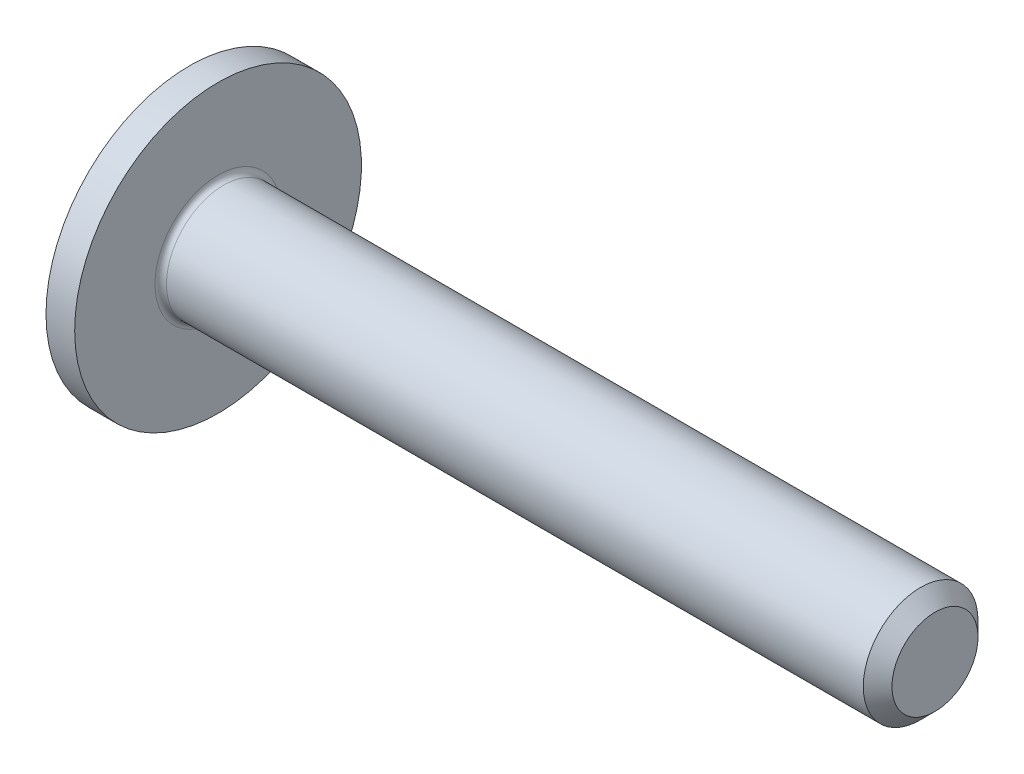
ISO-10303-21;
HEADER;
FILE_DESCRIPTION(('STEP AP214'),'2;1');
FILE_NAME('part.step','',(''),(''),'','','');
FILE_SCHEMA(('AUTOMOTIVE_DESIGN { 1 0 10303 214 1 1 1 1 }'));
ENDSEC;
DATA;
#1=APPLICATION_CONTEXT('core data for automotive mechanical design processes');
#2=APPLICATION_PROTOCOL_DEFINITION('international standard','automotive_design',2000,#1);
#3=PRODUCT_CONTEXT('',#1,'mechanical');
#4=PRODUCT('Part','Part','',(#3));
#5=PRODUCT_RELATED_PRODUCT_CATEGORY('part','',(#4));
#6=PRODUCT_DEFINITION_FORMATION('','',#4);
#7=PRODUCT_DEFINITION_CONTEXT('part definition',#1,'design');
#8=PRODUCT_DEFINITION('design','',#6,#7);
#9=PRODUCT_DEFINITION_SHAPE('','',#8);
#10=(LENGTH_UNIT() NAMED_UNIT(*) SI_UNIT(.MILLI.,.METRE.));
#11=(NAMED_UNIT(*) PLANE_ANGLE_UNIT() SI_UNIT($,.RADIAN.));
#12=(NAMED_UNIT(*) SI_UNIT($,.STERADIAN.) SOLID_ANGLE_UNIT());
#13=UNCERTAINTY_MEASURE_WITH_UNIT(LENGTH_MEASURE(1.E-05),#10,'distance_accuracy_value','');
#14=(GEOMETRIC_REPRESENTATION_CONTEXT(3) GLOBAL_UNCERTAINTY_ASSIGNED_CONTEXT((#13)) GLOBAL_UNIT_ASSIGNED_CONTEXT((#10,
#11,#12)) REPRESENTATION_CONTEXT('',''));
#15=CARTESIAN_POINT('',(0.,0.,0.));
#16=DIRECTION('',(0.,0.,1.));
#17=DIRECTION('',(1.,0.,0.));
#18=AXIS2_PLACEMENT_3D('',#15,#16,#17);
#19=CARTESIAN_POINT('',(5.8,0.,0.));
#20=DIRECTION('',(-1.,0.,0.));
#21=DIRECTION('',(0.,1.,0.));
#22=AXIS2_PLACEMENT_3D('',#19,#20,#21);
#23=SPHERICAL_SURFACE('',#22,5.8);
#24=CARTESIAN_POINT('',(2.05,0.,0.));
#25=DIRECTION('',(1.,0.,0.));
#26=DIRECTION('',(0.,0.,-1.));
#27=AXIS2_PLACEMENT_3D('',#24,#25,#26);
#28=CIRCLE('',#27,4.42464687856557);
#29=CARTESIAN_POINT('',(2.05,0.,-4.42464687856557));
#30=VERTEX_POINT('',#29);
#31=EDGE_CURVE('E425',#30,#30,#28,.F.);
#32=ORIENTED_EDGE('',*,*,#31,.T.);
#33=EDGE_LOOP('',(#32));
#34=FACE_BOUND('',#33,.T.);
#35=CARTESIAN_POINT('',(4.49544161532537,1.4868105318046,1.70147353185102));
#36=DIRECTION('',(0.5,-0.569852046972748,-0.652126248943384));
#37=DIRECTION('',(0.,0.753010530746168,-0.658008465435951));
#38=AXIS2_PLACEMENT_3D('',#35,#36,#37);
#39=CIRCLE('',#38,5.18001058723826);
#40=CARTESIAN_POINT('',(0.350670800180915,1.40442359564326,-1.40442359564326));
#41=VERTEX_POINT('',#40);
#42=CARTESIAN_POINT('',(0.0915426130173635,0.556694252642319,-0.862325791147635));
#43=VERTEX_POINT('',#42);
#44=EDGE_CURVE('E252',#41,#43,#39,.F.);
#45=ORIENTED_EDGE('',*,*,#44,.F.);
#46=CARTESIAN_POINT('',(4.49544161532537,-1.70147353185101,-1.48681053180461));
#47=DIRECTION('',(0.5,0.652126248943382,0.56985204697275));
#48=DIRECTION('',(0.,-0.658008465435953,0.753010530746166));
#49=AXIS2_PLACEMENT_3D('',#46,#47,#48);
#50=CIRCLE('',#49,5.18001058723826);
#51=CARTESIAN_POINT('',(0.0915426130173634,0.862325791147635,-0.556694252642316));
#52=VERTEX_POINT('',#51);
#53=EDGE_CURVE('E248',#52,#41,#50,.F.);
#54=ORIENTED_EDGE('',*,*,#53,.F.);
#55=CARTESIAN_POINT('',(0.0915426130173634,0.,0.));
#56=DIRECTION('',(1.,0.,0.));
#57=DIRECTION('',(0.,0.,-1.));
#58=AXIS2_PLACEMENT_3D('',#55,#56,#57);
#59=CIRCLE('',#58,1.02640842796783);
#60=CARTESIAN_POINT('',(0.0915426130173482,0.891122758840145,-0.509327487654908));
#61=VERTEX_POINT('',#60);
#62=EDGE_CURVE('E245',#61,#52,#59,.F.);
#63=ORIENTED_EDGE('',*,*,#62,.F.);
#64=CARTESIAN_POINT('',(5.80960489391217,0.,-0.155003115548179));
#65=DIRECTION('',(0.0618471864963983,0.,-0.998085630355672));
#66=DIRECTION('',(-0.998085630355672,0.,-0.0618471864963983));
#67=AXIS2_PLACEMENT_3D('',#64,#65,#66);
#68=CIRCLE('',#67,5.79792047032238);
#69=CARTESIAN_POINT('',(0.390286169611534,2.03324772703929,-0.490815600600994));
#70=VERTEX_POINT('',#69);
#71=EDGE_CURVE('E438',#61,#70,#68,.T.);
#72=ORIENTED_EDGE('',*,*,#71,.T.);
#73=CARTESIAN_POINT('',(5.91393656966609,0.380873675740914,0.));
#74=DIRECTION('',(0.286596561114572,0.958051361440138,0.));
#75=DIRECTION('',(-0.958051361440138,0.286596561114572,0.));
#76=AXIS2_PLACEMENT_3D('',#73,#74,#75);
#77=CIRCLE('',#76,5.78635927861555);
#78=CARTESIAN_POINT('',(0.390286169611536,2.03324772703929,0.490815600600995));
#79=VERTEX_POINT('',#78);
#80=EDGE_CURVE('E435',#70,#79,#77,.T.);
#81=ORIENTED_EDGE('',*,*,#80,.T.);
#82=CARTESIAN_POINT('',(5.80960489391217,0.,0.155003115548176));
#83=DIRECTION('',(0.0618471864963987,0.,0.998085630355672));
#84=DIRECTION('',(0.998085630355672,0.,-0.0618471864963988));
#85=AXIS2_PLACEMENT_3D('',#82,#83,#84);
#86=CIRCLE('',#85,5.79792047032238);
#87=CARTESIAN_POINT('',(0.091542613017363,0.891122758839946,0.509327487654907));
#88=VERTEX_POINT('',#87);
#89=EDGE_CURVE('E443',#79,#88,#86,.T.);
#90=ORIENTED_EDGE('',*,*,#89,.T.);
#91=CARTESIAN_POINT('',(0.0915426130173634,0.862325791147635,0.556694252642317));
#92=VERTEX_POINT('',#91);
#93=EDGE_CURVE('E267',#92,#88,#59,.F.);
#94=ORIENTED_EDGE('',*,*,#93,.F.);
#95=CARTESIAN_POINT('',(4.49544161532536,-1.70147353185101,1.48681053180461));
#96=DIRECTION('',(0.5,0.652126248943382,-0.56985204697275));
#97=DIRECTION('',(0.,0.658008465435953,0.753010530746166));
#98=AXIS2_PLACEMENT_3D('',#95,#96,#97);
#99=CIRCLE('',#98,5.18001058723826);
#100=CARTESIAN_POINT('',(0.350670800180912,1.40442359564326,1.40442359564326));
#101=VERTEX_POINT('',#100);
#102=EDGE_CURVE('E253',#101,#92,#99,.F.);
#103=ORIENTED_EDGE('',*,*,#102,.F.);
#104=CARTESIAN_POINT('',(4.49544161532537,1.4868105318046,-1.70147353185102));
#105=DIRECTION('',(0.5,-0.569852046972748,0.652126248943384));
#106=DIRECTION('',(0.,-0.753010530746168,-0.658008465435951));
#107=AXIS2_PLACEMENT_3D('',#104,#105,#106);
#108=CIRCLE('',#107,5.18001058723826);
#109=CARTESIAN_POINT('',(0.0915426130173635,0.556694252642319,0.862325791147635));
#110=VERTEX_POINT('',#109);
#111=EDGE_CURVE('E256',#110,#101,#108,.F.);
#112=ORIENTED_EDGE('',*,*,#111,.F.);
#113=CARTESIAN_POINT('',(0.0915426130173482,0.509327487654905,0.891122758840146));
#114=VERTEX_POINT('',#113);
#115=EDGE_CURVE('E270',#114,#110,#59,.F.);
#116=ORIENTED_EDGE('',*,*,#115,.F.);
#117=CARTESIAN_POINT('',(5.80960489391217,0.155003115548179,0.));
#118=DIRECTION('',(0.0618471864963983,0.998085630355672,0.));
#119=DIRECTION('',(-0.998085630355672,0.0618471864963983,0.));
#120=AXIS2_PLACEMENT_3D('',#117,#118,#119);
#121=CIRCLE('',#120,5.79792047032238);
#122=CARTESIAN_POINT('',(0.390286169611534,0.490815600600987,2.03324772703929));
#123=VERTEX_POINT('',#122);
#124=EDGE_CURVE('E767',#114,#123,#121,.T.);
#125=ORIENTED_EDGE('',*,*,#124,.T.);
#126=CARTESIAN_POINT('',(5.91393656966609,0.,0.380873675740914));
#127=DIRECTION('',(0.286596561114572,0.,0.958051361440138));
#128=DIRECTION('',(0.958051361440138,0.,-0.286596561114572));
#129=AXIS2_PLACEMENT_3D('',#126,#127,#128);
#130=CIRCLE('',#129,5.78635927861555);
#131=CARTESIAN_POINT('',(0.390286169611536,-0.490815600601002,2.03324772703929));
#132=VERTEX_POINT('',#131);
#133=EDGE_CURVE('E449',#123,#132,#130,.T.);
#134=ORIENTED_EDGE('',*,*,#133,.T.);
#135=CARTESIAN_POINT('',(5.80960489391217,-0.155003115548176,0.));
#136=DIRECTION('',(0.0618471864963987,-0.998085630355672,0.));
#137=DIRECTION('',(0.998085630355672,0.0618471864963988,0.));
#138=AXIS2_PLACEMENT_3D('',#135,#136,#137);
#139=CIRCLE('',#138,5.79792047032238);
#140=CARTESIAN_POINT('',(0.0915426130173487,-0.509327487654911,0.891122758840143));
#141=VERTEX_POINT('',#140);
#142=EDGE_CURVE('E771',#132,#141,#139,.T.);
#143=ORIENTED_EDGE('',*,*,#142,.T.);
#144=CARTESIAN_POINT('',(0.0915426130173635,-0.556694252642319,0.862325791147635));
#145=VERTEX_POINT('',#144);
#146=EDGE_CURVE('E740',#145,#141,#59,.F.);
#147=ORIENTED_EDGE('',*,*,#146,.F.);
#148=CARTESIAN_POINT('',(4.49544161532537,-1.4868105318046,-1.70147353185102));
#149=DIRECTION('',(0.5,0.569852046972748,0.652126248943384));
#150=DIRECTION('',(0.,-0.753010530746168,0.658008465435951));
#151=AXIS2_PLACEMENT_3D('',#148,#149,#150);
#152=CIRCLE('',#151,5.18001058723826);
#153=CARTESIAN_POINT('',(0.350670800180915,-1.40442359564326,1.40442359564326));
#154=VERTEX_POINT('',#153);
#155=EDGE_CURVE('E734',#154,#145,#152,.F.);
#156=ORIENTED_EDGE('',*,*,#155,.F.);
#157=CARTESIAN_POINT('',(4.49544161532537,1.70147353185101,1.48681053180461));
#158=DIRECTION('',(0.5,-0.652126248943382,-0.56985204697275));
#159=DIRECTION('',(0.,0.658008465435953,-0.753010530746166));
#160=AXIS2_PLACEMENT_3D('',#157,#158,#159);
#161=CIRCLE('',#160,5.18001058723826);
#162=CARTESIAN_POINT('',(0.0915426130173634,-0.862325791147635,0.556694252642316));
#163=VERTEX_POINT('',#162);
#164=EDGE_CURVE('E728',#163,#154,#161,.F.);
#165=ORIENTED_EDGE('',*,*,#164,.F.);
#166=CARTESIAN_POINT('',(0.091542613017363,-0.891122758839946,0.509327487654907));
#167=VERTEX_POINT('',#166);
#168=EDGE_CURVE('E275',#167,#163,#59,.F.);
#169=ORIENTED_EDGE('',*,*,#168,.F.);
#170=CARTESIAN_POINT('',(0.390286169611532,-2.03324772703928,0.490815600600995));
#171=VERTEX_POINT('',#170);
#172=EDGE_CURVE('E442',#167,#171,#86,.T.);
#173=ORIENTED_EDGE('',*,*,#172,.T.);
#174=CARTESIAN_POINT('',(5.91393656966608,-0.380873675740915,0.));
#175=DIRECTION('',(0.28659656111457,-0.958051361440138,0.));
#176=DIRECTION('',(0.958051361440138,0.28659656111457,0.));
#177=AXIS2_PLACEMENT_3D('',#174,#175,#176);
#178=CIRCLE('',#177,5.78635927861555);
#179=CARTESIAN_POINT('',(0.390286169611532,-2.03324772703928,-0.490815600600995));
#180=VERTEX_POINT('',#179);
#181=EDGE_CURVE('E446',#171,#180,#178,.T.);
#182=ORIENTED_EDGE('',*,*,#181,.T.);
#183=CARTESIAN_POINT('',(0.0915426130173493,-0.891122758840144,-0.509327487654908));
#184=VERTEX_POINT('',#183);
#185=EDGE_CURVE('E439',#180,#184,#68,.T.);
#186=ORIENTED_EDGE('',*,*,#185,.T.);
#187=CARTESIAN_POINT('',(0.0915426130173634,-0.862325791147635,-0.556694252642317));
#188=VERTEX_POINT('',#187);
#189=EDGE_CURVE('E741',#188,#184,#59,.F.);
#190=ORIENTED_EDGE('',*,*,#189,.F.);
#191=CARTESIAN_POINT('',(4.49544161532536,1.70147353185101,-1.48681053180461));
#192=DIRECTION('',(0.5,-0.652126248943382,0.56985204697275));
#193=DIRECTION('',(0.,-0.658008465435953,-0.753010530746166));
#194=AXIS2_PLACEMENT_3D('',#191,#192,#193);
#195=CIRCLE('',#194,5.18001058723826);
#196=CARTESIAN_POINT('',(0.350670800180914,-1.40442359564326,-1.40442359564326));
#197=VERTEX_POINT('',#196);
#198=EDGE_CURVE('E210',#197,#188,#195,.F.);
#199=ORIENTED_EDGE('',*,*,#198,.F.);
#200=CARTESIAN_POINT('',(4.49544161532537,-1.4868105318046,1.70147353185102));
#201=DIRECTION('',(0.5,0.569852046972748,-0.652126248943384));
#202=DIRECTION('',(0.,0.753010530746168,0.658008465435951));
#203=AXIS2_PLACEMENT_3D('',#200,#201,#202);
#204=CIRCLE('',#203,5.18001058723826);
#205=CARTESIAN_POINT('',(0.0915426130173635,-0.556694252642319,-0.862325791147635));
#206=VERTEX_POINT('',#205);
#207=EDGE_CURVE('E220',#206,#197,#204,.F.);
#208=ORIENTED_EDGE('',*,*,#207,.F.);
#209=CARTESIAN_POINT('',(0.0915426130173629,-0.509327487654904,-0.891122758839948));
#210=VERTEX_POINT('',#209);
#211=EDGE_CURVE('E227',#210,#206,#59,.F.);
#212=ORIENTED_EDGE('',*,*,#211,.F.);
#213=CARTESIAN_POINT('',(0.390286169611532,-0.490815600600988,-2.03324772703928));
#214=VERTEX_POINT('',#213);
#215=EDGE_CURVE('E769',#210,#214,#139,.T.);
#216=ORIENTED_EDGE('',*,*,#215,.T.);
#217=CARTESIAN_POINT('',(5.91393656966608,0.,-0.380873675740915));
#218=DIRECTION('',(0.28659656111457,0.,-0.958051361440138));
#219=DIRECTION('',(-0.958051361440138,0.,-0.28659656111457));
#220=AXIS2_PLACEMENT_3D('',#217,#218,#219);
#221=CIRCLE('',#220,5.78635927861555);
#222=CARTESIAN_POINT('',(0.390286169611532,0.490815600601002,-2.03324772703928));
#223=VERTEX_POINT('',#222);
#224=EDGE_CURVE('E451',#214,#223,#221,.T.);
#225=ORIENTED_EDGE('',*,*,#224,.T.);
#226=CARTESIAN_POINT('',(0.0915426130173631,0.50932748765491,-0.891122758839945));
#227=VERTEX_POINT('',#226);
#228=EDGE_CURVE('E765',#223,#227,#121,.T.);
#229=ORIENTED_EDGE('',*,*,#228,.T.);
#230=EDGE_CURVE('E274',#43,#227,#59,.F.);
#231=ORIENTED_EDGE('',*,*,#230,.F.);
#232=EDGE_LOOP('',(#45,#54,#63,#72,#81,#90,#94,#103,#112,#116,#125,#134,#143,#147,#156,#165,
#169,#173,#182,#186,#190,#199,#208,#212,#216,#225,#229,#231));
#233=FACE_BOUND('',#232,.T.);
#234=ADVANCED_FACE('F41',(#34,#233),#23,.T.);
#235=CARTESIAN_POINT('',(2.6,0.,0.));
#236=DIRECTION('',(-1.,0.,0.));
#237=DIRECTION('',(0.,0.,1.));
#238=AXIS2_PLACEMENT_3D('',#235,#236,#237);
#239=CONICAL_SURFACE('',#238,0.850999999999999,0.069813170079766);
#240=CARTESIAN_POINT('',(2.6,0.,0.));
#241=DIRECTION('',(-1.,0.,0.));
#242=DIRECTION('',(0.,0.,1.));
#243=AXIS2_PLACEMENT_3D('',#240,#241,#242);
#244=CIRCLE('',#243,0.850999999999999);
#245=CARTESIAN_POINT('',(2.6,0.,0.850999999999999));
#246=VERTEX_POINT('',#245);
#247=EDGE_CURVE('E261',#246,#246,#244,.T.);
#248=ORIENTED_EDGE('',*,*,#247,.F.);
#249=EDGE_LOOP('',(#248));
#250=FACE_BOUND('',#249,.T.);
#251=CARTESIAN_POINT('',(0.370538725217989,0.0918314341366152,0.0802457051897276));
#252=DIRECTION('',(0.5,0.652126248943382,0.56985204697275));
#253=DIRECTION('',(-0.866025403784438,0.376505265373083,0.329004232717977));
#254=AXIS2_PLACEMENT_3D('',#251,#252,#253);
#255=ELLIPSE('',#254,2.013798238594,0.999486593679023);
#256=CARTESIAN_POINT('',(0.465382099864511,0.707295596002861,-0.70729559600286));
#257=VERTEX_POINT('',#256);
#258=EDGE_CURVE('E49',#52,#257,#255,.F.);
#259=ORIENTED_EDGE('',*,*,#258,.T.);
#260=CARTESIAN_POINT('',(0.370538725217985,-0.0802457051897285,-0.0918314341366171));
#261=DIRECTION('',(0.5,-0.569852046972748,-0.652126248943384));
#262=DIRECTION('',(-0.866025403784439,-0.329004232717976,-0.376505265373084));
#263=AXIS2_PLACEMENT_3D('',#260,#261,#262);
#264=ELLIPSE('',#263,2.01379823859401,0.999486593679024);
#265=EDGE_CURVE('E11',#257,#43,#264,.F.);
#266=ORIENTED_EDGE('',*,*,#265,.T.);
#267=ORIENTED_EDGE('',*,*,#230,.T.);
#268=CARTESIAN_POINT('',(0.0452078804564265,0.512198656980268,-0.893212462768129));
#269=CARTESIAN_POINT('',(0.365106160426383,0.492375900315463,-0.87879018372941));
#270=CARTESIAN_POINT('',(0.684997245175192,0.472553589508378,-0.864205051965348));
#271=CARTESIAN_POINT('',(1.32476098967625,0.432910109614082,-0.834642123898892));
#272=CARTESIAN_POINT('',(1.64463364944747,0.413088940525694,-0.819664328008124));
#273=CARTESIAN_POINT('',(2.08973198362717,0.385508060843619,-0.798502412906335));
#274=CARTESIAN_POINT('',(2.2149668823717,0.377747778656458,-0.792512888403489));
#275=CARTESIAN_POINT('',(2.3402,0.369987606837611,-0.786486121868666));
#276=B_SPLINE_CURVE_WITH_KNOTS('',3,(#268,#269,#270,#271,#272,#273,#274,#275),.UNSPECIFIED.,.F.,
.F.,(4,2,2,4),(0.,0.962508687501757,1.92501636605824,2.30187028300653),.UNSPECIFIED.);
#277=CARTESIAN_POINT('',(2.34,0.370000000000003,-0.786495747306727));
#278=VERTEX_POINT('',#277);
#279=EDGE_CURVE('E337',#227,#278,#276,.T.);
#280=ORIENTED_EDGE('',*,*,#279,.T.);
#281=CARTESIAN_POINT('',(2.34,0.,0.));
#282=DIRECTION('',(-1.,0.,0.));
#283=DIRECTION('',(0.,0.,1.));
#284=AXIS2_PLACEMENT_3D('',#281,#282,#283);
#285=CIRCLE('',#284,0.86918097110531);
#286=CARTESIAN_POINT('',(2.34,-0.369999999999997,-0.78649574730673));
#287=VERTEX_POINT('',#286);
#288=EDGE_CURVE('E268',#287,#278,#285,.F.);
#289=ORIENTED_EDGE('',*,*,#288,.F.);
#290=CARTESIAN_POINT('',(2.3402,-0.369987606837604,-0.786486121868669));
#291=CARTESIAN_POINT('',(2.07019913746138,-0.386718429516279,-0.799478554072587));
#292=CARTESIAN_POINT('',(1.80019009427807,-0.403449759115245,-0.812299140431048));
#293=CARTESIAN_POINT('',(1.26015794483742,-0.436913289742977,-0.837635105994263));
#294=CARTESIAN_POINT('',(0.990134838591079,-0.453645490771063,-0.850150485434047));
#295=CARTESIAN_POINT('',(0.495143747104779,-0.484318015670855,-0.872848007294731));
#296=CARTESIAN_POINT('',(0.270177625154038,-0.498258224082332,-0.883070947346796));
#297=CARTESIAN_POINT('',(0.0452078804564248,-0.512198656980261,-0.893212462768132));
#298=B_SPLINE_CURVE_WITH_KNOTS('',3,(#290,#291,#292,#293,#294,#295,#296,#297),.UNSPECIFIED.,.F.,
.F.,(4,2,2,4),(0.,0.812491523202115,1.62498242071296,2.30187030608887),.UNSPECIFIED.);
#299=EDGE_CURVE('E342',#287,#210,#298,.T.);
#300=ORIENTED_EDGE('',*,*,#299,.T.);
#301=ORIENTED_EDGE('',*,*,#211,.T.);
#302=CARTESIAN_POINT('',(0.370538725217985,0.0802457051897285,-0.0918314341366171));
#303=DIRECTION('',(0.5,0.569852046972748,-0.652126248943384));
#304=DIRECTION('',(-0.866025403784439,0.329004232717976,-0.376505265373084));
#305=AXIS2_PLACEMENT_3D('',#302,#303,#304);
#306=ELLIPSE('',#305,2.01379823859401,0.999486593679024);
#307=CARTESIAN_POINT('',(0.46538209986451,-0.707295596002862,-0.707295596002861));
#308=VERTEX_POINT('',#307);
#309=EDGE_CURVE('E214',#206,#308,#306,.F.);
#310=ORIENTED_EDGE('',*,*,#309,.T.);
#311=CARTESIAN_POINT('',(0.370538725217987,-0.0918314341366153,0.0802457051897275));
#312=DIRECTION('',(0.5,-0.652126248943382,0.56985204697275));
#313=DIRECTION('',(-0.866025403784438,-0.376505265373083,0.329004232717977));
#314=AXIS2_PLACEMENT_3D('',#311,#312,#313);
#315=ELLIPSE('',#314,2.01379823859401,0.999486593679023);
#316=EDGE_CURVE('E205',#308,#188,#315,.F.);
#317=ORIENTED_EDGE('',*,*,#316,.T.);
#318=ORIENTED_EDGE('',*,*,#189,.T.);
#319=CARTESIAN_POINT('',(0.0452078804564248,-0.89321246276813,-0.512198656980265));
#320=CARTESIAN_POINT('',(0.365106160426381,-0.878790183729412,-0.49237590031546));
#321=CARTESIAN_POINT('',(0.68499724517519,-0.864205051965349,-0.472553589508375));
#322=CARTESIAN_POINT('',(1.32476098967625,-0.834642123898894,-0.432910109614079));
#323=CARTESIAN_POINT('',(1.64463364944747,-0.819664328008126,-0.413088940525692));
#324=CARTESIAN_POINT('',(2.08973198362717,-0.798502412906337,-0.385508060843616));
#325=CARTESIAN_POINT('',(2.2149668823717,-0.792512888403491,-0.377747778656455));
#326=CARTESIAN_POINT('',(2.3402,-0.786486121868667,-0.369987606837608));
#327=B_SPLINE_CURVE_WITH_KNOTS('',3,(#319,#320,#321,#322,#323,#324,#325,#326),.UNSPECIFIED.,.F.,
.F.,(4,2,2,4),(0.,0.962508687501757,1.92501636605824,2.30187028300653),.UNSPECIFIED.);
#328=CARTESIAN_POINT('',(2.34,-0.786495747306728,-0.370000000000001));
#329=VERTEX_POINT('',#328);
#330=EDGE_CURVE('E331',#184,#329,#327,.T.);
#331=ORIENTED_EDGE('',*,*,#330,.T.);
#332=CARTESIAN_POINT('',(2.34,-0.786495747306729,0.37));
#333=VERTEX_POINT('',#332);
#334=EDGE_CURVE('E743',#333,#329,#285,.F.);
#335=ORIENTED_EDGE('',*,*,#334,.F.);
#336=CARTESIAN_POINT('',(2.3402,-0.786486121868668,0.369987606837607));
#337=CARTESIAN_POINT('',(2.07019913746138,-0.799478554072585,0.386718429516282));
#338=CARTESIAN_POINT('',(1.80019009427807,-0.812299140431046,0.403449759115247));
#339=CARTESIAN_POINT('',(1.26015794483742,-0.837635105994262,0.43691328974298));
#340=CARTESIAN_POINT('',(0.990134838591079,-0.850150485434045,0.453645490771066));
#341=CARTESIAN_POINT('',(0.495143747104779,-0.872848007294729,0.484318015670858));
#342=CARTESIAN_POINT('',(0.270177625154038,-0.883070947346795,0.498258224082335));
#343=CARTESIAN_POINT('',(0.0452078804564257,-0.89321246276813,0.512198656980265));
#344=B_SPLINE_CURVE_WITH_KNOTS('',3,(#336,#337,#338,#339,#340,#341,#342,#343),.UNSPECIFIED.,.F.,
.F.,(4,2,2,4),(0.,0.812491523202115,1.62498242071296,2.30187030608887),.UNSPECIFIED.);
#345=EDGE_CURVE('E317',#333,#167,#344,.T.);
#346=ORIENTED_EDGE('',*,*,#345,.T.);
#347=ORIENTED_EDGE('',*,*,#168,.T.);
#348=CARTESIAN_POINT('',(0.370538725217989,-0.0918314341366152,-0.0802457051897276));
#349=DIRECTION('',(0.5,-0.652126248943382,-0.56985204697275));
#350=DIRECTION('',(-0.866025403784438,-0.376505265373083,-0.329004232717977));
#351=AXIS2_PLACEMENT_3D('',#348,#349,#350);
#352=ELLIPSE('',#351,2.013798238594,0.999486593679023);
#353=CARTESIAN_POINT('',(0.465382099864511,-0.707295596002861,0.70729559600286));
#354=VERTEX_POINT('',#353);
#355=EDGE_CURVE('E228',#163,#354,#352,.F.);
#356=ORIENTED_EDGE('',*,*,#355,.T.);
#357=CARTESIAN_POINT('',(0.370538725217985,0.0802457051897285,0.0918314341366171));
#358=DIRECTION('',(0.5,0.569852046972748,0.652126248943384));
#359=DIRECTION('',(-0.866025403784439,0.329004232717976,0.376505265373084));
#360=AXIS2_PLACEMENT_3D('',#357,#358,#359);
#361=ELLIPSE('',#360,2.01379823859401,0.999486593679024);
#362=EDGE_CURVE('E231',#354,#145,#361,.F.);
#363=ORIENTED_EDGE('',*,*,#362,.T.);
#364=ORIENTED_EDGE('',*,*,#146,.T.);
#365=CARTESIAN_POINT('',(0.0452078804564256,-0.512198656980268,0.893212462768128));
#366=CARTESIAN_POINT('',(0.365106160426382,-0.492375900315463,0.878790183729411));
#367=CARTESIAN_POINT('',(0.684997245175191,-0.472553589508378,0.864205051965348));
#368=CARTESIAN_POINT('',(1.32476098967625,-0.432910109614081,0.834642123898892));
#369=CARTESIAN_POINT('',(1.64463364944747,-0.413088940525694,0.819664328008125));
#370=CARTESIAN_POINT('',(2.08973198362717,-0.385508060843618,0.798502412906336));
#371=CARTESIAN_POINT('',(2.2149668823717,-0.377747778656457,0.79251288840349));
#372=CARTESIAN_POINT('',(2.3402,-0.36998760683761,0.786486121868666));
#373=B_SPLINE_CURVE_WITH_KNOTS('',3,(#365,#366,#367,#368,#369,#370,#371,#372),.UNSPECIFIED.,.F.,
.F.,(4,2,2,4),(0.,0.962508687501757,1.92501636605824,2.30187028300653),.UNSPECIFIED.);
#374=CARTESIAN_POINT('',(2.34,-0.370000000000002,0.786495747306728));
#375=VERTEX_POINT('',#374);
#376=EDGE_CURVE('E273',#141,#375,#373,.T.);
#377=ORIENTED_EDGE('',*,*,#376,.T.);
#378=CARTESIAN_POINT('',(2.34,0.369999999999998,0.78649574730673));
#379=VERTEX_POINT('',#378);
#380=EDGE_CURVE('E264',#379,#375,#285,.F.);
#381=ORIENTED_EDGE('',*,*,#380,.F.);
#382=CARTESIAN_POINT('',(2.3402,0.369987606837605,0.786486121868668));
#383=CARTESIAN_POINT('',(2.07019913746138,0.386718429516279,0.799478554072586));
#384=CARTESIAN_POINT('',(1.80019009427807,0.403449759115245,0.812299140431047));
#385=CARTESIAN_POINT('',(1.26015794483742,0.436913289742977,0.837635105994263));
#386=CARTESIAN_POINT('',(0.990134838591079,0.453645490771063,0.850150485434047));
#387=CARTESIAN_POINT('',(0.495143747104779,0.484318015670855,0.872848007294731));
#388=CARTESIAN_POINT('',(0.270177625154038,0.498258224082332,0.883070947346797));
#389=CARTESIAN_POINT('',(0.0452078804564249,0.512198656980261,0.893212462768132));
#390=B_SPLINE_CURVE_WITH_KNOTS('',3,(#382,#383,#384,#385,#386,#387,#388,#389),.UNSPECIFIED.,.F.,
.F.,(4,2,2,4),(0.,0.812491523202115,1.62498242071296,2.30187030608887),.UNSPECIFIED.);
#391=EDGE_CURVE('E305',#379,#114,#390,.T.);
#392=ORIENTED_EDGE('',*,*,#391,.T.);
#393=ORIENTED_EDGE('',*,*,#115,.T.);
#394=CARTESIAN_POINT('',(0.370538725217985,-0.0802457051897285,0.0918314341366171));
#395=DIRECTION('',(0.5,-0.569852046972748,0.652126248943384));
#396=DIRECTION('',(-0.866025403784439,-0.329004232717976,0.376505265373084));
#397=AXIS2_PLACEMENT_3D('',#394,#395,#396);
#398=ELLIPSE('',#397,2.01379823859401,0.999486593679024);
#399=CARTESIAN_POINT('',(0.46538209986451,0.707295596002865,0.707295596002863));
#400=VERTEX_POINT('',#399);
#401=EDGE_CURVE('E237',#110,#400,#398,.F.);
#402=ORIENTED_EDGE('',*,*,#401,.T.);
#403=CARTESIAN_POINT('',(0.370538725217987,0.0918314341366153,-0.0802457051897275));
#404=DIRECTION('',(0.5,0.652126248943382,-0.56985204697275));
#405=DIRECTION('',(-0.866025403784438,0.376505265373083,-0.329004232717977));
#406=AXIS2_PLACEMENT_3D('',#403,#404,#405);
#407=ELLIPSE('',#406,2.01379823859401,0.999486593679023);
#408=EDGE_CURVE('E240',#400,#92,#407,.F.);
#409=ORIENTED_EDGE('',*,*,#408,.T.);
#410=ORIENTED_EDGE('',*,*,#93,.T.);
#411=CARTESIAN_POINT('',(0.0452078804564248,0.89321246276813,0.512198656980265));
#412=CARTESIAN_POINT('',(0.365106160426381,0.878790183729412,0.49237590031546));
#413=CARTESIAN_POINT('',(0.68499724517519,0.864205051965349,0.472553589508375));
#414=CARTESIAN_POINT('',(1.32476098967625,0.834642123898894,0.432910109614078));
#415=CARTESIAN_POINT('',(1.64463364944747,0.819664328008126,0.413088940525691));
#416=CARTESIAN_POINT('',(2.08973198362717,0.798502412906337,0.385508060843615));
#417=CARTESIAN_POINT('',(2.2149668823717,0.792512888403491,0.377747778656454));
#418=CARTESIAN_POINT('',(2.3402,0.786486121868668,0.369987606837607));
#419=B_SPLINE_CURVE_WITH_KNOTS('',3,(#411,#412,#413,#414,#415,#416,#417,#418),.UNSPECIFIED.,.F.,
.F.,(4,2,2,4),(0.,0.962508687501757,1.92501636605824,2.30187028300653),.UNSPECIFIED.);
#420=CARTESIAN_POINT('',(2.34,0.786495747306729,0.37));
#421=VERTEX_POINT('',#420);
#422=EDGE_CURVE('E283',#88,#421,#419,.T.);
#423=ORIENTED_EDGE('',*,*,#422,.T.);
#424=CARTESIAN_POINT('',(2.34,0.786495747306729,-0.370000000000001));
#425=VERTEX_POINT('',#424);
#426=EDGE_CURVE('E269',#425,#421,#285,.F.);
#427=ORIENTED_EDGE('',*,*,#426,.F.);
#428=CARTESIAN_POINT('',(2.3402,0.786486121868667,-0.369987606837608));
#429=CARTESIAN_POINT('',(2.07019913746138,0.799478554072585,-0.386718429516282));
#430=CARTESIAN_POINT('',(1.80019009427807,0.812299140431046,-0.403449759115248));
#431=CARTESIAN_POINT('',(1.26015794483742,0.837635105994262,-0.43691328974298));
#432=CARTESIAN_POINT('',(0.990134838591079,0.850150485434045,-0.453645490771066));
#433=CARTESIAN_POINT('',(0.495143747104779,0.872848007294729,-0.484318015670858));
#434=CARTESIAN_POINT('',(0.270177625154039,0.883070947346795,-0.498258224082335));
#435=CARTESIAN_POINT('',(0.0452078804564265,0.893212462768131,-0.512198656980264));
#436=B_SPLINE_CURVE_WITH_KNOTS('',3,(#428,#429,#430,#431,#432,#433,#434,#435),.UNSPECIFIED.,.F.,
.F.,(4,2,2,4),(0.,0.812491523202115,1.62498242071296,2.30187030608887),.UNSPECIFIED.);
#437=EDGE_CURVE('E324',#425,#61,#436,.T.);
#438=ORIENTED_EDGE('',*,*,#437,.T.);
#439=ORIENTED_EDGE('',*,*,#62,.T.);
#440=EDGE_LOOP('',(#259,#266,#267,#280,#289,#300,#301,#310,#317,#318,#331,#335,#346,#347,#356,
#363,#364,#377,#381,#392,#393,#402,#409,#410,#423,#427,#438,#439));
#441=FACE_BOUND('',#440,.T.);
#442=ADVANCED_FACE('F225',(#250,#441),#239,.F.);
#443=CARTESIAN_POINT('',(0.,-2.14999999999999,0.515));
#444=DIRECTION('',(0.0618471864963987,0.,0.998085630355672));
#445=DIRECTION('',(0.998085630355672,0.,-0.0618471864963988));
#446=AXIS2_PLACEMENT_3D('',#443,#444,#445);
#447=PLANE('',#446);
#448=ORIENTED_EDGE('',*,*,#345,.F.);
#449=DIRECTION('',(0.,1.,0.));
#450=VECTOR('',#449,1.);
#451=CARTESIAN_POINT('',(2.34,-1.45,0.37));
#452=LINE('',#451,#450);
#453=CARTESIAN_POINT('',(2.34,-1.45,0.37));
#454=VERTEX_POINT('',#453);
#455=EDGE_CURVE('E786',#454,#333,#452,.T.);
#456=ORIENTED_EDGE('',*,*,#455,.F.);
#457=DIRECTION('',(0.956367545721271,0.286092855557644,-0.0592620915083696));
#458=VECTOR('',#457,1.);
#459=CARTESIAN_POINT('',(0.,-2.14999999999999,0.515));
#460=LINE('',#459,#458);
#461=EDGE_CURVE('E543',#171,#454,#460,.T.);
#462=ORIENTED_EDGE('',*,*,#461,.F.);
#463=ORIENTED_EDGE('',*,*,#172,.F.);
#464=EDGE_LOOP('',(#448,#456,#462,#463));
#465=FACE_BOUND('',#464,.T.);
#466=ADVANCED_FACE('F297',(#465),#447,.F.);
#467=CARTESIAN_POINT('',(0.,2.15000000000001,-0.515));
#468=DIRECTION('',(0.0618471864963983,0.,-0.998085630355672));
#469=DIRECTION('',(-0.998085630355672,0.,-0.0618471864963983));
#470=AXIS2_PLACEMENT_3D('',#467,#468,#469);
#471=PLANE('',#470);
#472=ORIENTED_EDGE('',*,*,#330,.F.);
#473=ORIENTED_EDGE('',*,*,#185,.F.);
#474=DIRECTION('',(0.956367545721271,0.286092855557644,0.0592620915083691));
#475=VECTOR('',#474,1.);
#476=CARTESIAN_POINT('',(0.,-2.14999999999999,-0.515));
#477=LINE('',#476,#475);
#478=CARTESIAN_POINT('',(2.34,-1.45,-0.370000000000001));
#479=VERTEX_POINT('',#478);
#480=EDGE_CURVE('E773',#180,#479,#477,.T.);
#481=ORIENTED_EDGE('',*,*,#480,.T.);
#482=DIRECTION('',(0.,-1.,0.));
#483=VECTOR('',#482,1.);
#484=CARTESIAN_POINT('',(2.34,1.45,-0.37));
#485=LINE('',#484,#483);
#486=EDGE_CURVE('E785',#329,#479,#485,.T.);
#487=ORIENTED_EDGE('',*,*,#486,.F.);
#488=EDGE_LOOP('',(#472,#473,#481,#487));
#489=FACE_BOUND('',#488,.T.);
#490=ADVANCED_FACE('F367',(#489),#471,.F.);
#491=ORIENTED_EDGE('',*,*,#422,.F.);
#492=ORIENTED_EDGE('',*,*,#89,.F.);
#493=DIRECTION('',(0.95636754572127,-0.286092855557646,-0.0592620915083695));
#494=VECTOR('',#493,1.);
#495=CARTESIAN_POINT('',(0.,2.15000000000001,0.515));
#496=LINE('',#495,#494);
#497=CARTESIAN_POINT('',(2.34,1.45,0.37));
#498=VERTEX_POINT('',#497);
#499=EDGE_CURVE('E776',#79,#498,#496,.T.);
#500=ORIENTED_EDGE('',*,*,#499,.T.);
#501=EDGE_CURVE('E792',#421,#498,#452,.T.);
#502=ORIENTED_EDGE('',*,*,#501,.F.);
#503=EDGE_LOOP('',(#491,#492,#500,#502));
#504=FACE_BOUND('',#503,.T.);
#505=ADVANCED_FACE('F369',(#504),#447,.F.);
#506=ORIENTED_EDGE('',*,*,#437,.F.);
#507=CARTESIAN_POINT('',(2.34,1.45,-0.37));
#508=VERTEX_POINT('',#507);
#509=EDGE_CURVE('E787',#508,#425,#485,.T.);
#510=ORIENTED_EDGE('',*,*,#509,.F.);
#511=DIRECTION('',(0.95636754572127,-0.286092855557646,0.059262091508369));
#512=VECTOR('',#511,1.);
#513=CARTESIAN_POINT('',(0.,2.15000000000001,-0.515));
#514=LINE('',#513,#512);
#515=EDGE_CURVE('E779',#70,#508,#514,.T.);
#516=ORIENTED_EDGE('',*,*,#515,.F.);
#517=ORIENTED_EDGE('',*,*,#71,.F.);
#518=EDGE_LOOP('',(#506,#510,#516,#517));
#519=FACE_BOUND('',#518,.T.);
#520=ADVANCED_FACE('F375',(#519),#471,.F.);
#521=CARTESIAN_POINT('',(2.34,1.45,0.37));
#522=DIRECTION('',(-1.,0.,0.));
#523=DIRECTION('',(0.,0.,1.));
#524=AXIS2_PLACEMENT_3D('',#521,#522,#523);
#525=PLANE('',#524);
#526=ORIENTED_EDGE('',*,*,#455,.T.);
#527=ORIENTED_EDGE('',*,*,#334,.T.);
#528=ORIENTED_EDGE('',*,*,#486,.T.);
#529=DIRECTION('',(0.,0.,1.));
#530=VECTOR('',#529,1.);
#531=CARTESIAN_POINT('',(2.34,-1.45,-0.370000000000001));
#532=LINE('',#531,#530);
#533=EDGE_CURVE('E781',#479,#454,#532,.T.);
#534=ORIENTED_EDGE('',*,*,#533,.T.);
#535=EDGE_LOOP('',(#526,#527,#528,#534));
#536=FACE_BOUND('',#535,.T.);
#537=ADVANCED_FACE('F384',(#536),#525,.T.);
#538=DIRECTION('',(0.,0.,1.));
#539=VECTOR('',#538,1.);
#540=CARTESIAN_POINT('',(2.34,-0.369999999999995,-1.45));
#541=LINE('',#540,#539);
#542=CARTESIAN_POINT('',(2.34,-0.369999999999995,-1.45));
#543=VERTEX_POINT('',#542);
#544=EDGE_CURVE('E755',#543,#287,#541,.T.);
#545=ORIENTED_EDGE('',*,*,#544,.T.);
#546=ORIENTED_EDGE('',*,*,#288,.T.);
#547=DIRECTION('',(0.,0.,-1.));
#548=VECTOR('',#547,1.);
#549=CARTESIAN_POINT('',(2.34,0.369999999999995,1.45000000000001));
#550=LINE('',#549,#548);
#551=CARTESIAN_POINT('',(2.34,0.370000000000006,-1.44999999999999));
#552=VERTEX_POINT('',#551);
#553=EDGE_CURVE('E811',#278,#552,#550,.T.);
#554=ORIENTED_EDGE('',*,*,#553,.T.);
#555=DIRECTION('',(0.,-1.,0.));
#556=VECTOR('',#555,1.);
#557=CARTESIAN_POINT('',(2.34,0.370000000000006,-1.44999999999999));
#558=LINE('',#557,#556);
#559=EDGE_CURVE('E763',#552,#543,#558,.T.);
#560=ORIENTED_EDGE('',*,*,#559,.T.);
#561=EDGE_LOOP('',(#545,#546,#554,#560));
#562=FACE_BOUND('',#561,.T.);
#563=ADVANCED_FACE('F578',(#562),#525,.T.);
#564=ORIENTED_EDGE('',*,*,#509,.T.);
#565=ORIENTED_EDGE('',*,*,#426,.T.);
#566=ORIENTED_EDGE('',*,*,#501,.T.);
#567=DIRECTION('',(0.,0.,-1.));
#568=VECTOR('',#567,1.);
#569=CARTESIAN_POINT('',(2.34,1.45,0.37));
#570=LINE('',#569,#568);
#571=EDGE_CURVE('E782',#498,#508,#570,.T.);
#572=ORIENTED_EDGE('',*,*,#571,.T.);
#573=EDGE_LOOP('',(#564,#565,#566,#572));
#574=FACE_BOUND('',#573,.T.);
#575=ADVANCED_FACE('F352',(#574),#525,.T.);
#576=CARTESIAN_POINT('',(0.,0.514999999999992,2.15000000000001));
#577=DIRECTION('',(0.0618471864963983,0.998085630355672,0.));
#578=DIRECTION('',(-0.998085630355672,0.0618471864963983,0.));
#579=AXIS2_PLACEMENT_3D('',#576,#577,#578);
#580=PLANE('',#579);
#581=ORIENTED_EDGE('',*,*,#279,.F.);
#582=ORIENTED_EDGE('',*,*,#228,.F.);
#583=DIRECTION('',(0.956367545721271,-0.0592620915083701,0.286092855557644));
#584=VECTOR('',#583,1.);
#585=CARTESIAN_POINT('',(0.,0.515000000000008,-2.14999999999999));
#586=LINE('',#585,#584);
#587=EDGE_CURVE('E804',#223,#552,#586,.T.);
#588=ORIENTED_EDGE('',*,*,#587,.T.);
#589=ORIENTED_EDGE('',*,*,#553,.F.);
#590=EDGE_LOOP('',(#581,#582,#588,#589));
#591=FACE_BOUND('',#590,.T.);
#592=ADVANCED_FACE('F348',(#591),#580,.F.);
#593=CARTESIAN_POINT('',(0.,-0.514999999999993,-2.15));
#594=DIRECTION('',(0.0618471864963987,-0.998085630355672,0.));
#595=DIRECTION('',(0.998085630355672,0.0618471864963988,0.));
#596=AXIS2_PLACEMENT_3D('',#593,#594,#595);
#597=PLANE('',#596);
#598=ORIENTED_EDGE('',*,*,#299,.F.);
#599=ORIENTED_EDGE('',*,*,#544,.F.);
#600=DIRECTION('',(0.956367545721271,0.0592620915083686,0.286092855557644));
#601=VECTOR('',#600,1.);
#602=CARTESIAN_POINT('',(0.,-0.514999999999993,-2.15));
#603=LINE('',#602,#601);
#604=EDGE_CURVE('E768',#214,#543,#603,.T.);
#605=ORIENTED_EDGE('',*,*,#604,.F.);
#606=ORIENTED_EDGE('',*,*,#215,.F.);
#607=EDGE_LOOP('',(#598,#599,#605,#606));
#608=FACE_BOUND('',#607,.T.);
#609=ADVANCED_FACE('F290',(#608),#597,.F.);
#610=ORIENTED_EDGE('',*,*,#376,.F.);
#611=ORIENTED_EDGE('',*,*,#142,.F.);
#612=DIRECTION('',(0.95636754572127,0.0592620915083705,-0.286092855557646));
#613=VECTOR('',#612,1.);
#614=CARTESIAN_POINT('',(0.,-0.515000000000008,2.15));
#615=LINE('',#614,#613);
#616=CARTESIAN_POINT('',(2.34,-0.370000000000005,1.45));
#617=VERTEX_POINT('',#616);
#618=EDGE_CURVE('E801',#132,#617,#615,.T.);
#619=ORIENTED_EDGE('',*,*,#618,.T.);
#620=EDGE_CURVE('E753',#375,#617,#541,.T.);
#621=ORIENTED_EDGE('',*,*,#620,.F.);
#622=EDGE_LOOP('',(#610,#611,#619,#621));
#623=FACE_BOUND('',#622,.T.);
#624=ADVANCED_FACE('F601',(#623),#597,.F.);
#625=ORIENTED_EDGE('',*,*,#391,.F.);
#626=CARTESIAN_POINT('',(2.34,0.369999999999995,1.45000000000001));
#627=VERTEX_POINT('',#626);
#628=EDGE_CURVE('E812',#627,#379,#550,.T.);
#629=ORIENTED_EDGE('',*,*,#628,.F.);
#630=DIRECTION('',(0.95636754572127,-0.059262091508368,-0.286092855557646));
#631=VECTOR('',#630,1.);
#632=CARTESIAN_POINT('',(0.,0.514999999999992,2.15000000000001));
#633=LINE('',#632,#631);
#634=EDGE_CURVE('E805',#123,#627,#633,.T.);
#635=ORIENTED_EDGE('',*,*,#634,.F.);
#636=ORIENTED_EDGE('',*,*,#124,.F.);
#637=EDGE_LOOP('',(#625,#629,#635,#636));
#638=FACE_BOUND('',#637,.T.);
#639=ADVANCED_FACE('F354',(#638),#580,.F.);
#640=CARTESIAN_POINT('',(-6.34999999999999,0.,0.));
#641=DIRECTION('',(-1.,0.,0.));
#642=DIRECTION('',(0.,0.,1.));
#643=AXIS2_PLACEMENT_3D('',#640,#641,#642);
#644=CYLINDRICAL_SURFACE('',#643,2.00000000000001);
#645=CARTESIAN_POINT('',(27.55,0.,0.));
#646=DIRECTION('',(1.,0.,0.));
#647=DIRECTION('',(0.,0.,-1.));
#648=AXIS2_PLACEMENT_3D('',#645,#646,#647);
#649=CIRCLE('',#648,2.00000000000001);
#650=CARTESIAN_POINT('',(27.55,0.,-2.00000000000001));
#651=VERTEX_POINT('',#650);
#652=EDGE_CURVE('E455',#651,#651,#649,.F.);
#653=ORIENTED_EDGE('',*,*,#652,.T.);
#654=EDGE_LOOP('',(#653));
#655=FACE_BOUND('',#654,.T.);
#656=CARTESIAN_POINT('',(3.25,0.,0.));
#657=DIRECTION('',(-1.,0.,0.));
#658=DIRECTION('',(0.,0.,1.));
#659=AXIS2_PLACEMENT_3D('',#656,#657,#658);
#660=CIRCLE('',#659,2.00000000000001);
#661=CARTESIAN_POINT('',(3.25,0.,2.00000000000001));
#662=VERTEX_POINT('',#661);
#663=EDGE_CURVE('E414',#662,#662,#660,.F.);
#664=ORIENTED_EDGE('',*,*,#663,.T.);
#665=EDGE_LOOP('',(#664));
#666=FACE_BOUND('',#665,.T.);
#667=ADVANCED_FACE('F403',(#655,#666),#644,.T.);
#668=CARTESIAN_POINT('',(28.05,2.00000000000001,0.));
#669=DIRECTION('',(1.,0.,0.));
#670=DIRECTION('',(0.,0.,-1.));
#671=AXIS2_PLACEMENT_3D('',#668,#669,#670);
#672=PLANE('',#671);
#673=CARTESIAN_POINT('',(28.05,0.,0.));
#674=DIRECTION('',(1.,0.,0.));
#675=DIRECTION('',(0.,0.,-1.));
#676=AXIS2_PLACEMENT_3D('',#673,#674,#675);
#677=CIRCLE('',#676,1.50000000000001);
#678=CARTESIAN_POINT('',(28.05,0.,-1.50000000000001));
#679=VERTEX_POINT('',#678);
#680=EDGE_CURVE('E215',#679,#679,#677,.T.);
#681=ORIENTED_EDGE('',*,*,#680,.T.);
#682=EDGE_LOOP('',(#681));
#683=FACE_BOUND('',#682,.T.);
#684=ADVANCED_FACE('F399',(#683),#672,.T.);
#685=CARTESIAN_POINT('',(2.05,5.,0.));
#686=DIRECTION('',(1.,0.,0.));
#687=DIRECTION('',(0.,0.,-1.));
#688=AXIS2_PLACEMENT_3D('',#685,#686,#687);
#689=PLANE('',#688);
#690=ORIENTED_EDGE('',*,*,#31,.F.);
#691=EDGE_LOOP('',(#690));
#692=FACE_BOUND('',#691,.T.);
#693=CARTESIAN_POINT('',(2.05,0.,0.));
#694=DIRECTION('',(-1.,0.,0.));
#695=DIRECTION('',(0.,0.,1.));
#696=AXIS2_PLACEMENT_3D('',#693,#694,#695);
#697=CIRCLE('',#696,5.);
#698=CARTESIAN_POINT('',(2.05,0.,5.));
#699=VERTEX_POINT('',#698);
#700=EDGE_CURVE('E419',#699,#699,#697,.T.);
#701=ORIENTED_EDGE('',*,*,#700,.T.);
#702=EDGE_LOOP('',(#701));
#703=FACE_BOUND('',#702,.T.);
#704=ADVANCED_FACE('F395',(#692,#703),#689,.F.);
#705=CARTESIAN_POINT('',(-6.34999999999999,0.,0.));
#706=DIRECTION('',(-1.,0.,0.));
#707=DIRECTION('',(0.,0.,1.));
#708=AXIS2_PLACEMENT_3D('',#705,#706,#707);
#709=CYLINDRICAL_SURFACE('',#708,5.);
#710=ORIENTED_EDGE('',*,*,#700,.F.);
#711=EDGE_LOOP('',(#710));
#712=FACE_BOUND('',#711,.T.);
#713=CARTESIAN_POINT('',(3.05,0.,0.));
#714=DIRECTION('',(-1.,0.,0.));
#715=DIRECTION('',(0.,0.,1.));
#716=AXIS2_PLACEMENT_3D('',#713,#714,#715);
#717=CIRCLE('',#716,5.);
#718=CARTESIAN_POINT('',(3.05,0.,5.));
#719=VERTEX_POINT('',#718);
#720=EDGE_CURVE('E429',#719,#719,#717,.T.);
#721=ORIENTED_EDGE('',*,*,#720,.T.);
#722=EDGE_LOOP('',(#721));
#723=FACE_BOUND('',#722,.T.);
#724=ADVANCED_FACE('F391',(#712,#723),#709,.T.);
#725=CARTESIAN_POINT('',(3.05,2.,0.));
#726=DIRECTION('',(-1.,0.,0.));
#727=DIRECTION('',(0.,0.,1.));
#728=AXIS2_PLACEMENT_3D('',#725,#726,#727);
#729=PLANE('',#728);
#730=CARTESIAN_POINT('',(3.05,0.,0.));
#731=DIRECTION('',(-1.,0.,0.));
#732=DIRECTION('',(0.,0.,1.));
#733=AXIS2_PLACEMENT_3D('',#730,#731,#732);
#734=CIRCLE('',#733,2.20000000000001);
#735=CARTESIAN_POINT('',(3.05,0.,2.20000000000001));
#736=VERTEX_POINT('',#735);
#737=EDGE_CURVE('E417',#736,#736,#734,.T.);
#738=ORIENTED_EDGE('',*,*,#737,.T.);
#739=EDGE_LOOP('',(#738));
#740=FACE_BOUND('',#739,.T.);
#741=ORIENTED_EDGE('',*,*,#720,.F.);
#742=EDGE_LOOP('',(#741));
#743=FACE_BOUND('',#742,.T.);
#744=ADVANCED_FACE('F388',(#740,#743),#729,.F.);
#745=CARTESIAN_POINT('',(3.25,0.,0.));
#746=DIRECTION('',(-1.,0.,0.));
#747=DIRECTION('',(0.,0.,1.));
#748=AXIS2_PLACEMENT_3D('',#745,#746,#747);
#749=TOROIDAL_SURFACE('',#748,2.20000000000001,0.2);
#750=ORIENTED_EDGE('',*,*,#663,.F.);
#751=EDGE_LOOP('',(#750));
#752=FACE_BOUND('',#751,.T.);
#753=ORIENTED_EDGE('',*,*,#737,.F.);
#754=EDGE_LOOP('',(#753));
#755=FACE_BOUND('',#754,.T.);
#756=ADVANCED_FACE('F363',(#752,#755),#749,.F.);
#757=CARTESIAN_POINT('',(2.34,-1.45,-0.370000000000001));
#758=DIRECTION('',(0.28659656111457,-0.958051361440138,0.));
#759=DIRECTION('',(0.958051361440138,0.28659656111457,0.));
#760=AXIS2_PLACEMENT_3D('',#757,#758,#759);
#761=PLANE('',#760);
#762=ORIENTED_EDGE('',*,*,#461,.T.);
#763=ORIENTED_EDGE('',*,*,#533,.F.);
#764=ORIENTED_EDGE('',*,*,#480,.F.);
#765=ORIENTED_EDGE('',*,*,#181,.F.);
#766=EDGE_LOOP('',(#762,#763,#764,#765));
#767=FACE_BOUND('',#766,.T.);
#768=ADVANCED_FACE('F360',(#767),#761,.F.);
#769=CARTESIAN_POINT('',(2.34,1.45,0.37));
#770=DIRECTION('',(0.286596561114572,0.958051361440138,0.));
#771=DIRECTION('',(-0.958051361440138,0.286596561114572,0.));
#772=AXIS2_PLACEMENT_3D('',#769,#770,#771);
#773=PLANE('',#772);
#774=ORIENTED_EDGE('',*,*,#515,.T.);
#775=ORIENTED_EDGE('',*,*,#571,.F.);
#776=ORIENTED_EDGE('',*,*,#499,.F.);
#777=ORIENTED_EDGE('',*,*,#80,.F.);
#778=EDGE_LOOP('',(#774,#775,#776,#777));
#779=FACE_BOUND('',#778,.T.);
#780=ADVANCED_FACE('F362',(#779),#773,.F.);
#781=ORIENTED_EDGE('',*,*,#628,.T.);
#782=ORIENTED_EDGE('',*,*,#380,.T.);
#783=ORIENTED_EDGE('',*,*,#620,.T.);
#784=DIRECTION('',(0.,1.,0.));
#785=VECTOR('',#784,1.);
#786=CARTESIAN_POINT('',(2.34,-0.370000000000005,1.45));
#787=LINE('',#786,#785);
#788=EDGE_CURVE('E760',#617,#627,#787,.T.);
#789=ORIENTED_EDGE('',*,*,#788,.T.);
#790=EDGE_LOOP('',(#781,#782,#783,#789));
#791=FACE_BOUND('',#790,.T.);
#792=ADVANCED_FACE('F379',(#791),#525,.T.);
#793=CARTESIAN_POINT('',(2.34,0.370000000000006,-1.44999999999999));
#794=DIRECTION('',(0.28659656111457,0.,-0.958051361440138));
#795=DIRECTION('',(0.958051361440138,0.,0.28659656111457));
#796=AXIS2_PLACEMENT_3D('',#793,#794,#795);
#797=PLANE('',#796);
#798=ORIENTED_EDGE('',*,*,#604,.T.);
#799=ORIENTED_EDGE('',*,*,#559,.F.);
#800=ORIENTED_EDGE('',*,*,#587,.F.);
#801=ORIENTED_EDGE('',*,*,#224,.F.);
#802=EDGE_LOOP('',(#798,#799,#800,#801));
#803=FACE_BOUND('',#802,.T.);
#804=ADVANCED_FACE('F301',(#803),#797,.F.);
#805=CARTESIAN_POINT('',(2.34,-0.370000000000005,1.45));
#806=DIRECTION('',(0.286596561114572,0.,0.958051361440138));
#807=DIRECTION('',(-0.958051361440138,0.,0.286596561114572));
#808=AXIS2_PLACEMENT_3D('',#805,#806,#807);
#809=PLANE('',#808);
#810=ORIENTED_EDGE('',*,*,#634,.T.);
#811=ORIENTED_EDGE('',*,*,#788,.F.);
#812=ORIENTED_EDGE('',*,*,#618,.F.);
#813=ORIENTED_EDGE('',*,*,#133,.F.);
#814=EDGE_LOOP('',(#810,#811,#812,#813));
#815=FACE_BOUND('',#814,.T.);
#816=ADVANCED_FACE('F355',(#815),#809,.F.);
#817=CARTESIAN_POINT('',(2.8765066614942,0.,0.));
#818=DIRECTION('',(-1.,0.,0.));
#819=DIRECTION('',(0.,0.,1.));
#820=AXIS2_PLACEMENT_3D('',#817,#818,#819);
#821=CONICAL_SURFACE('',#820,0.,1.25663706143592);
#822=ORIENTED_EDGE('',*,*,#247,.T.);
#823=EDGE_LOOP('',(#822));
#824=FACE_BOUND('',#823,.T.);
#825=CARTESIAN_POINT('',(2.8765066614942,0.,0.));
#826=VERTEX_POINT('',#825);
#827=VERTEX_LOOP('',#826);
#828=FACE_BOUND('',#827,.T.);
#829=ADVANCED_FACE('F299',(#824,#828),#821,.F.);
#830=CARTESIAN_POINT('',(27.55,0.,0.));
#831=DIRECTION('',(-1.,0.,0.));
#832=DIRECTION('',(0.,0.,1.));
#833=AXIS2_PLACEMENT_3D('',#830,#831,#832);
#834=CONICAL_SURFACE('',#833,2.00000000000001,0.785398163397457);
#835=ORIENTED_EDGE('',*,*,#680,.F.);
#836=EDGE_LOOP('',(#835));
#837=FACE_BOUND('',#836,.T.);
#838=ORIENTED_EDGE('',*,*,#652,.F.);
#839=EDGE_LOOP('',(#838));
#840=FACE_BOUND('',#839,.T.);
#841=ADVANCED_FACE('F43',(#837,#840),#834,.T.);
#842=CARTESIAN_POINT('',(0.,-0.446053553467664,0.));
#843=DIRECTION('',(0.5,-0.652126248943382,0.56985204697275));
#844=DIRECTION('',(0.,-0.658008465435953,-0.753010530746166));
#845=AXIS2_PLACEMENT_3D('',#842,#843,#844);
#846=PLANE('',#845);
#847=ORIENTED_EDGE('',*,*,#198,.T.);
#848=ORIENTED_EDGE('',*,*,#316,.F.);
#849=DIRECTION('',(-0.115573599460621,-0.702368401591259,-0.702368401591257));
#850=VECTOR('',#849,1.);
#851=CARTESIAN_POINT('',(0.,-3.53553390593274,-3.53553390593273));
#852=LINE('',#851,#850);
#853=EDGE_CURVE('E208',#308,#197,#852,.T.);
#854=ORIENTED_EDGE('',*,*,#853,.T.);
#855=EDGE_LOOP('',(#847,#848,#854));
#856=FACE_BOUND('',#855,.T.);
#857=ADVANCED_FACE('F207',(#856),#846,.F.);
#858=CARTESIAN_POINT('',(0.,-3.53553390593274,-3.53553390593273));
#859=DIRECTION('',(0.5,0.569852046972748,-0.652126248943384));
#860=DIRECTION('',(0.,0.753010530746168,0.658008465435951));
#861=AXIS2_PLACEMENT_3D('',#858,#859,#860);
#862=PLANE('',#861);
#863=ORIENTED_EDGE('',*,*,#207,.T.);
#864=ORIENTED_EDGE('',*,*,#853,.F.);
#865=ORIENTED_EDGE('',*,*,#309,.F.);
#866=EDGE_LOOP('',(#863,#864,#865));
#867=FACE_BOUND('',#866,.T.);
#868=ADVANCED_FACE('F218',(#867),#862,.F.);
#869=CARTESIAN_POINT('',(0.,-3.53553390593274,3.53553390593273));
#870=DIRECTION('',(0.5,-0.652126248943382,-0.56985204697275));
#871=DIRECTION('',(0.,0.658008465435953,-0.753010530746166));
#872=AXIS2_PLACEMENT_3D('',#869,#870,#871);
#873=PLANE('',#872);
#874=ORIENTED_EDGE('',*,*,#164,.T.);
#875=DIRECTION('',(-0.115573599460621,-0.702368401591259,0.702368401591256));
#876=VECTOR('',#875,1.);
#877=CARTESIAN_POINT('',(0.,-3.53553390593274,3.53553390593273));
#878=LINE('',#877,#876);
#879=EDGE_CURVE('E221',#354,#154,#878,.T.);
#880=ORIENTED_EDGE('',*,*,#879,.F.);
#881=ORIENTED_EDGE('',*,*,#355,.F.);
#882=EDGE_LOOP('',(#874,#880,#881));
#883=FACE_BOUND('',#882,.T.);
#884=ADVANCED_FACE('F668',(#883),#873,.F.);
#885=CARTESIAN_POINT('',(0.,0.,0.446053553467664));
#886=DIRECTION('',(0.5,0.569852046972748,0.652126248943384));
#887=DIRECTION('',(0.,-0.753010530746168,0.658008465435951));
#888=AXIS2_PLACEMENT_3D('',#885,#886,#887);
#889=PLANE('',#888);
#890=ORIENTED_EDGE('',*,*,#155,.T.);
#891=ORIENTED_EDGE('',*,*,#362,.F.);
#892=ORIENTED_EDGE('',*,*,#879,.T.);
#893=EDGE_LOOP('',(#890,#891,#892));
#894=FACE_BOUND('',#893,.T.);
#895=ADVANCED_FACE('F676',(#894),#889,.F.);
#896=CARTESIAN_POINT('',(0.,3.53553390593274,3.53553390593273));
#897=DIRECTION('',(0.5,-0.569852046972748,0.652126248943384));
#898=DIRECTION('',(0.,-0.753010530746168,-0.658008465435951));
#899=AXIS2_PLACEMENT_3D('',#896,#897,#898);
#900=PLANE('',#899);
#901=ORIENTED_EDGE('',*,*,#111,.T.);
#902=DIRECTION('',(-0.115573599460621,0.702368401591259,0.702368401591257));
#903=VECTOR('',#902,1.);
#904=CARTESIAN_POINT('',(0.,3.53553390593274,3.53553390593273));
#905=LINE('',#904,#903);
#906=EDGE_CURVE('E64',#400,#101,#905,.T.);
#907=ORIENTED_EDGE('',*,*,#906,.F.);
#908=ORIENTED_EDGE('',*,*,#401,.F.);
#909=EDGE_LOOP('',(#901,#907,#908));
#910=FACE_BOUND('',#909,.T.);
#911=ADVANCED_FACE('F685',(#910),#900,.F.);
#912=CARTESIAN_POINT('',(0.,0.446053553467664,0.));
#913=DIRECTION('',(0.5,0.652126248943382,-0.56985204697275));
#914=DIRECTION('',(0.,0.658008465435953,0.753010530746166));
#915=AXIS2_PLACEMENT_3D('',#912,#913,#914);
#916=PLANE('',#915);
#917=ORIENTED_EDGE('',*,*,#102,.T.);
#918=ORIENTED_EDGE('',*,*,#408,.F.);
#919=ORIENTED_EDGE('',*,*,#906,.T.);
#920=EDGE_LOOP('',(#917,#918,#919));
#921=FACE_BOUND('',#920,.T.);
#922=ADVANCED_FACE('F694',(#921),#916,.F.);
#923=CARTESIAN_POINT('',(0.,0.,-0.446053553467664));
#924=DIRECTION('',(0.5,-0.569852046972748,-0.652126248943384));
#925=DIRECTION('',(0.,0.753010530746168,-0.658008465435951));
#926=AXIS2_PLACEMENT_3D('',#923,#924,#925);
#927=PLANE('',#926);
#928=ORIENTED_EDGE('',*,*,#44,.T.);
#929=ORIENTED_EDGE('',*,*,#265,.F.);
#930=DIRECTION('',(-0.115573599460621,0.702368401591259,-0.702368401591256));
#931=VECTOR('',#930,1.);
#932=CARTESIAN_POINT('',(0.,3.53553390593274,-3.53553390593273));
#933=LINE('',#932,#931);
#934=EDGE_CURVE('E56',#257,#41,#933,.T.);
#935=ORIENTED_EDGE('',*,*,#934,.T.);
#936=EDGE_LOOP('',(#928,#929,#935));
#937=FACE_BOUND('',#936,.T.);
#938=ADVANCED_FACE('F702',(#937),#927,.F.);
#939=CARTESIAN_POINT('',(0.,3.53553390593274,-3.53553390593273));
#940=DIRECTION('',(0.5,0.652126248943382,0.56985204697275));
#941=DIRECTION('',(0.,-0.658008465435953,0.753010530746166));
#942=AXIS2_PLACEMENT_3D('',#939,#940,#941);
#943=PLANE('',#942);
#944=ORIENTED_EDGE('',*,*,#53,.T.);
#945=ORIENTED_EDGE('',*,*,#934,.F.);
#946=ORIENTED_EDGE('',*,*,#258,.F.);
#947=EDGE_LOOP('',(#944,#945,#946));
#948=FACE_BOUND('',#947,.T.);
#949=ADVANCED_FACE('F247',(#948),#943,.F.);
#950=CLOSED_SHELL('',(#234,#442,#466,#490,#505,#520,#537,#563,#575,#592,#609,#624,#639,#667,
#684,#704,#724,#744,#756,#768,#780,#792,#804,#816,#829,#841,#857,#868,#884,#895,#911,#922,#938,#949));
#951=MANIFOLD_SOLID_BREP('B2',#950);
#952=ADVANCED_BREP_SHAPE_REPRESENTATION('',(#18,#951),#14);
#953=SHAPE_DEFINITION_REPRESENTATION(#9,#952);
ENDSEC;
END-ISO-10303-21;
